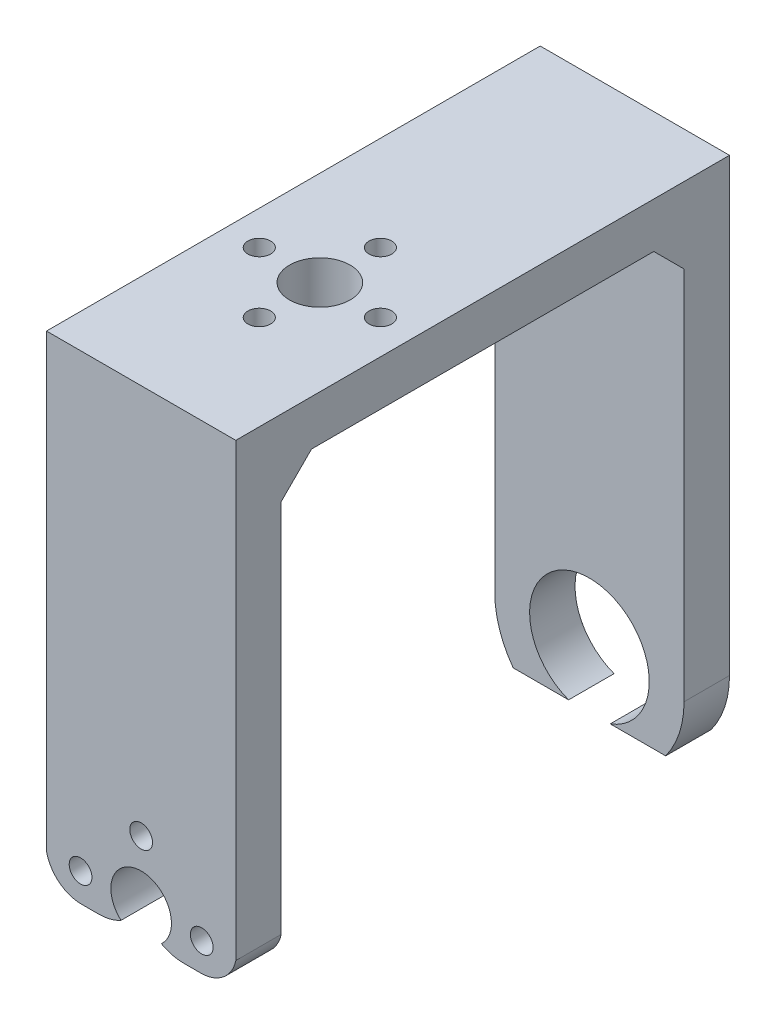
ISO-10303-21;
HEADER;
FILE_DESCRIPTION(('STEP AP214'),'2;1');
FILE_NAME('part.step','',(''),(''),'','','');
FILE_SCHEMA(('AUTOMOTIVE_DESIGN { 1 0 10303 214 1 1 1 1 }'));
ENDSEC;
DATA;
#1=APPLICATION_CONTEXT('core data for automotive mechanical design processes');
#2=APPLICATION_PROTOCOL_DEFINITION('international standard','automotive_design',2000,#1);
#3=PRODUCT_CONTEXT('',#1,'mechanical');
#4=PRODUCT('Part','Part','',(#3));
#5=PRODUCT_RELATED_PRODUCT_CATEGORY('part','',(#4));
#6=PRODUCT_DEFINITION_FORMATION('','',#4);
#7=PRODUCT_DEFINITION_CONTEXT('part definition',#1,'design');
#8=PRODUCT_DEFINITION('design','',#6,#7);
#9=PRODUCT_DEFINITION_SHAPE('','',#8);
#10=(LENGTH_UNIT() NAMED_UNIT(*) SI_UNIT(.MILLI.,.METRE.));
#11=(NAMED_UNIT(*) PLANE_ANGLE_UNIT() SI_UNIT($,.RADIAN.));
#12=(NAMED_UNIT(*) SI_UNIT($,.STERADIAN.) SOLID_ANGLE_UNIT());
#13=UNCERTAINTY_MEASURE_WITH_UNIT(LENGTH_MEASURE(1.E-05),#10,'distance_accuracy_value','');
#14=(GEOMETRIC_REPRESENTATION_CONTEXT(3) GLOBAL_UNCERTAINTY_ASSIGNED_CONTEXT((#13)) GLOBAL_UNIT_ASSIGNED_CONTEXT((#10,
#11,#12)) REPRESENTATION_CONTEXT('',''));
#15=CARTESIAN_POINT('',(0.,0.,0.));
#16=DIRECTION('',(0.,0.,1.));
#17=DIRECTION('',(1.,0.,0.));
#18=AXIS2_PLACEMENT_3D('',#15,#16,#17);
#19=CARTESIAN_POINT('',(25.,0.,0.));
#20=DIRECTION('',(-1.,0.,0.));
#21=DIRECTION('',(0.,0.,1.));
#22=AXIS2_PLACEMENT_3D('',#19,#20,#21);
#23=PLANE('',#22);
#24=DIRECTION('',(0.,-1.,0.));
#25=VECTOR('',#24,1.);
#26=CARTESIAN_POINT('',(25.,-20.3336150365916,32.6));
#27=LINE('',#26,#25);
#28=CARTESIAN_POINT('',(25.,49.6663849634084,32.6));
#29=VERTEX_POINT('',#28);
#30=CARTESIAN_POINT('',(25.,-9.83361503659156,32.6));
#31=VERTEX_POINT('',#30);
#32=EDGE_CURVE('E296',#29,#31,#27,.T.);
#33=ORIENTED_EDGE('',*,*,#32,.T.);
#34=DIRECTION('',(0.,0.,1.));
#35=VECTOR('',#34,1.);
#36=CARTESIAN_POINT('',(25.,-9.83361503659156,-32.601));
#37=LINE('',#36,#35);
#38=CARTESIAN_POINT('',(25.,-9.83361503659156,26.6));
#39=VERTEX_POINT('',#38);
#40=EDGE_CURVE('E394',#39,#31,#37,.T.);
#41=ORIENTED_EDGE('',*,*,#40,.F.);
#42=DIRECTION('',(0.,1.,0.));
#43=VECTOR('',#42,1.);
#44=CARTESIAN_POINT('',(25.,-20.3336150365916,26.6));
#45=LINE('',#44,#43);
#46=CARTESIAN_POINT('',(25.,39.6663849634085,26.6));
#47=VERTEX_POINT('',#46);
#48=EDGE_CURVE('E285',#39,#47,#45,.T.);
#49=ORIENTED_EDGE('',*,*,#48,.T.);
#50=DIRECTION('',(0.,-0.707106781186543,0.707106781186552));
#51=VECTOR('',#50,1.);
#52=CARTESIAN_POINT('',(25.,33.1331924817045,33.1331924817041));
#53=LINE('',#52,#51);
#54=CARTESIAN_POINT('',(25.,43.6663849634084,22.6));
#55=VERTEX_POINT('',#54);
#56=EDGE_CURVE('E331',#47,#55,#53,.F.);
#57=ORIENTED_EDGE('',*,*,#56,.T.);
#58=DIRECTION('',(0.,0.,-1.));
#59=VECTOR('',#58,1.);
#60=CARTESIAN_POINT('',(25.,43.6663849634084,26.6));
#61=LINE('',#60,#59);
#62=CARTESIAN_POINT('',(25.,43.6663849634085,-22.6));
#63=VERTEX_POINT('',#62);
#64=EDGE_CURVE('E287',#55,#63,#61,.T.);
#65=ORIENTED_EDGE('',*,*,#64,.T.);
#66=DIRECTION('',(0.,0.707106781186551,0.707106781186544));
#67=VECTOR('',#66,1.);
#68=CARTESIAN_POINT('',(25.,33.133192481704,-33.1331924817043));
#69=LINE('',#68,#67);
#70=CARTESIAN_POINT('',(25.,39.6663849634084,-26.6));
#71=VERTEX_POINT('',#70);
#72=EDGE_CURVE('E11',#63,#71,#69,.F.);
#73=ORIENTED_EDGE('',*,*,#72,.T.);
#74=DIRECTION('',(0.,-1.,0.));
#75=VECTOR('',#74,1.);
#76=CARTESIAN_POINT('',(25.,-20.3336150365916,-26.6));
#77=LINE('',#76,#75);
#78=CARTESIAN_POINT('',(25.,-9.83361503659156,-26.6));
#79=VERTEX_POINT('',#78);
#80=EDGE_CURVE('E290',#71,#79,#77,.T.);
#81=ORIENTED_EDGE('',*,*,#80,.T.);
#82=DIRECTION('',(0.,0.,-1.));
#83=VECTOR('',#82,1.);
#84=CARTESIAN_POINT('',(25.,-9.83361503659157,32.601));
#85=LINE('',#84,#83);
#86=CARTESIAN_POINT('',(25.,-9.83361503659156,-32.6));
#87=VERTEX_POINT('',#86);
#88=EDGE_CURVE('E280',#79,#87,#85,.T.);
#89=ORIENTED_EDGE('',*,*,#88,.T.);
#90=DIRECTION('',(0.,1.,0.));
#91=VECTOR('',#90,1.);
#92=CARTESIAN_POINT('',(25.,-20.3336150365916,-32.6));
#93=LINE('',#92,#91);
#94=CARTESIAN_POINT('',(25.,49.6663849634085,-32.6));
#95=VERTEX_POINT('',#94);
#96=EDGE_CURVE('E292',#87,#95,#93,.T.);
#97=ORIENTED_EDGE('',*,*,#96,.T.);
#98=DIRECTION('',(0.,0.,1.));
#99=VECTOR('',#98,1.);
#100=CARTESIAN_POINT('',(25.,49.6663849634084,32.6));
#101=LINE('',#100,#99);
#102=EDGE_CURVE('E294',#95,#29,#101,.T.);
#103=ORIENTED_EDGE('',*,*,#102,.T.);
#104=EDGE_LOOP('',(#33,#41,#49,#57,#65,#73,#81,#89,#97,#103));
#105=FACE_BOUND('',#104,.T.);
#106=ADVANCED_FACE('F35',(#105),#23,.F.);
#107=CARTESIAN_POINT('',(0.,0.,0.));
#108=DIRECTION('',(-1.,0.,0.));
#109=DIRECTION('',(0.,0.,1.));
#110=AXIS2_PLACEMENT_3D('',#107,#108,#109);
#111=PLANE('',#110);
#112=DIRECTION('',(0.,0.,1.));
#113=VECTOR('',#112,1.);
#114=CARTESIAN_POINT('',(0.,-9.83361503659156,-32.601));
#115=LINE('',#114,#113);
#116=CARTESIAN_POINT('',(0.,-9.83361503659156,26.6));
#117=VERTEX_POINT('',#116);
#118=CARTESIAN_POINT('',(0.,-9.83361503659156,32.6));
#119=VERTEX_POINT('',#118);
#120=EDGE_CURVE('E212',#117,#119,#115,.T.);
#121=ORIENTED_EDGE('',*,*,#120,.T.);
#122=DIRECTION('',(0.,-1.,0.));
#123=VECTOR('',#122,1.);
#124=CARTESIAN_POINT('',(0.,-20.3336150365916,32.6));
#125=LINE('',#124,#123);
#126=CARTESIAN_POINT('',(0.,49.6663849634084,32.6));
#127=VERTEX_POINT('',#126);
#128=EDGE_CURVE('E288',#127,#119,#125,.T.);
#129=ORIENTED_EDGE('',*,*,#128,.F.);
#130=DIRECTION('',(0.,0.,1.));
#131=VECTOR('',#130,1.);
#132=CARTESIAN_POINT('',(0.,49.6663849634084,32.6));
#133=LINE('',#132,#131);
#134=CARTESIAN_POINT('',(0.,49.6663849634085,-32.6));
#135=VERTEX_POINT('',#134);
#136=EDGE_CURVE('E308',#135,#127,#133,.T.);
#137=ORIENTED_EDGE('',*,*,#136,.F.);
#138=DIRECTION('',(0.,1.,0.));
#139=VECTOR('',#138,1.);
#140=CARTESIAN_POINT('',(0.,-20.3336150365916,-32.6));
#141=LINE('',#140,#139);
#142=CARTESIAN_POINT('',(0.,-9.83361503659156,-32.6));
#143=VERTEX_POINT('',#142);
#144=EDGE_CURVE('E306',#143,#135,#141,.T.);
#145=ORIENTED_EDGE('',*,*,#144,.F.);
#146=DIRECTION('',(0.,0.,-1.));
#147=VECTOR('',#146,1.);
#148=CARTESIAN_POINT('',(0.,-9.83361503659157,32.601));
#149=LINE('',#148,#147);
#150=CARTESIAN_POINT('',(0.,-9.83361503659156,-26.6));
#151=VERTEX_POINT('',#150);
#152=EDGE_CURVE('E278',#151,#143,#149,.T.);
#153=ORIENTED_EDGE('',*,*,#152,.F.);
#154=DIRECTION('',(0.,-1.,0.));
#155=VECTOR('',#154,1.);
#156=CARTESIAN_POINT('',(0.,-20.3336150365916,-26.6));
#157=LINE('',#156,#155);
#158=CARTESIAN_POINT('',(0.,39.6663849634084,-26.6));
#159=VERTEX_POINT('',#158);
#160=EDGE_CURVE('E304',#159,#151,#157,.T.);
#161=ORIENTED_EDGE('',*,*,#160,.F.);
#162=DIRECTION('',(0.,-0.707106781186551,-0.707106781186544));
#163=VECTOR('',#162,1.);
#164=CARTESIAN_POINT('',(0.,39.6663849634084,-26.6));
#165=LINE('',#164,#163);
#166=CARTESIAN_POINT('',(0.,43.6663849634085,-22.6));
#167=VERTEX_POINT('',#166);
#168=EDGE_CURVE('E43',#159,#167,#165,.F.);
#169=ORIENTED_EDGE('',*,*,#168,.T.);
#170=DIRECTION('',(0.,0.,-1.));
#171=VECTOR('',#170,1.);
#172=CARTESIAN_POINT('',(0.,43.6663849634084,26.6));
#173=LINE('',#172,#171);
#174=CARTESIAN_POINT('',(0.,43.6663849634084,22.6));
#175=VERTEX_POINT('',#174);
#176=EDGE_CURVE('E301',#175,#167,#173,.T.);
#177=ORIENTED_EDGE('',*,*,#176,.F.);
#178=DIRECTION('',(0.,0.707106781186543,-0.707106781186552));
#179=VECTOR('',#178,1.);
#180=CARTESIAN_POINT('',(0.,43.6663849634084,22.6));
#181=LINE('',#180,#179);
#182=CARTESIAN_POINT('',(0.,39.6663849634085,26.6));
#183=VERTEX_POINT('',#182);
#184=EDGE_CURVE('E328',#175,#183,#181,.F.);
#185=ORIENTED_EDGE('',*,*,#184,.T.);
#186=DIRECTION('',(0.,1.,0.));
#187=VECTOR('',#186,1.);
#188=CARTESIAN_POINT('',(0.,-20.3336150365916,26.6));
#189=LINE('',#188,#187);
#190=EDGE_CURVE('E271',#117,#183,#189,.T.);
#191=ORIENTED_EDGE('',*,*,#190,.F.);
#192=EDGE_LOOP('',(#121,#129,#137,#145,#153,#161,#169,#177,#185,#191));
#193=FACE_BOUND('',#192,.T.);
#194=ADVANCED_FACE('F336',(#193),#111,.T.);
#195=CARTESIAN_POINT('',(25.,-20.3336150365916,26.6));
#196=DIRECTION('',(0.,0.,1.));
#197=DIRECTION('',(1.,0.,0.));
#198=AXIS2_PLACEMENT_3D('',#195,#196,#197);
#199=PLANE('',#198);
#200=CARTESIAN_POINT('',(4.5,-9.83361503659157,26.6));
#201=DIRECTION('',(0.,0.,1.));
#202=DIRECTION('',(1.,0.,0.));
#203=AXIS2_PLACEMENT_3D('',#200,#201,#202);
#204=CIRCLE('',#203,1.5);
#205=CARTESIAN_POINT('',(6.,-9.83361503659157,26.6));
#206=VERTEX_POINT('',#205);
#207=EDGE_CURVE('E416',#206,#206,#204,.F.);
#208=ORIENTED_EDGE('',*,*,#207,.F.);
#209=EDGE_LOOP('',(#208));
#210=FACE_BOUND('',#209,.T.);
#211=CARTESIAN_POINT('',(12.5,-1.83361503659157,26.6));
#212=DIRECTION('',(0.,0.,1.));
#213=DIRECTION('',(1.,0.,0.));
#214=AXIS2_PLACEMENT_3D('',#211,#212,#213);
#215=CIRCLE('',#214,1.5);
#216=CARTESIAN_POINT('',(14.,-1.83361503659157,26.6));
#217=VERTEX_POINT('',#216);
#218=EDGE_CURVE('E423',#217,#217,#215,.F.);
#219=ORIENTED_EDGE('',*,*,#218,.F.);
#220=EDGE_LOOP('',(#219));
#221=FACE_BOUND('',#220,.T.);
#222=CARTESIAN_POINT('',(20.5,-9.83361503659157,26.6));
#223=DIRECTION('',(0.,0.,1.));
#224=DIRECTION('',(1.,0.,0.));
#225=AXIS2_PLACEMENT_3D('',#222,#223,#224);
#226=CIRCLE('',#225,1.5);
#227=CARTESIAN_POINT('',(22.,-9.83361503659157,26.6));
#228=VERTEX_POINT('',#227);
#229=EDGE_CURVE('E431',#228,#228,#226,.F.);
#230=ORIENTED_EDGE('',*,*,#229,.F.);
#231=EDGE_LOOP('',(#230));
#232=FACE_BOUND('',#231,.T.);
#233=ORIENTED_EDGE('',*,*,#48,.F.);
#234=CARTESIAN_POINT('',(20.3949022686378,-8.8749149936171,26.6));
#235=DIRECTION('',(0.,0.,1.));
#236=DIRECTION('',(1.,0.,0.));
#237=AXIS2_PLACEMENT_3D('',#234,#235,#236);
#238=CIRCLE('',#237,4.70383151141672);
#239=CARTESIAN_POINT('',(20.3949022686378,-13.5787465050338,26.6));
#240=VERTEX_POINT('',#239);
#241=EDGE_CURVE('E193',#240,#39,#238,.T.);
#242=ORIENTED_EDGE('',*,*,#241,.F.);
#243=DIRECTION('',(1.,0.,0.));
#244=VECTOR('',#243,1.);
#245=CARTESIAN_POINT('',(20.3949022686378,-13.5787465050338,26.6));
#246=LINE('',#245,#244);
#247=CARTESIAN_POINT('',(18.1039391702705,-13.5787465050338,26.6));
#248=VERTEX_POINT('',#247);
#249=EDGE_CURVE('E175',#248,#240,#246,.T.);
#250=ORIENTED_EDGE('',*,*,#249,.F.);
#251=CARTESIAN_POINT('',(18.1066775417596,-7.50942214918966,26.6));
#252=DIRECTION('',(0.,0.,1.));
#253=DIRECTION('',(1.,0.,0.));
#254=AXIS2_PLACEMENT_3D('',#251,#252,#253);
#255=CIRCLE('',#254,6.06932497359645);
#256=CARTESIAN_POINT('',(15.1638377890353,-12.8175668179894,26.6));
#257=VERTEX_POINT('',#256);
#258=EDGE_CURVE('E183',#257,#248,#255,.T.);
#259=ORIENTED_EDGE('',*,*,#258,.F.);
#260=CARTESIAN_POINT('',(12.5,-9.83361503659156,26.6));
#261=DIRECTION('',(0.,0.,1.));
#262=DIRECTION('',(1.,0.,0.));
#263=AXIS2_PLACEMENT_3D('',#260,#261,#262);
#264=CIRCLE('',#263,4.);
#265=CARTESIAN_POINT('',(9.83616221096467,-12.8175668179894,26.6));
#266=VERTEX_POINT('',#265);
#267=EDGE_CURVE('E189',#266,#257,#264,.F.);
#268=ORIENTED_EDGE('',*,*,#267,.F.);
#269=CARTESIAN_POINT('',(6.89332245824035,-7.50942214918966,26.6));
#270=DIRECTION('',(0.,0.,1.));
#271=DIRECTION('',(1.,0.,0.));
#272=AXIS2_PLACEMENT_3D('',#269,#270,#271);
#273=CIRCLE('',#272,6.06932497359645);
#274=CARTESIAN_POINT('',(6.89606082972947,-13.5787465050338,26.6));
#275=VERTEX_POINT('',#274);
#276=EDGE_CURVE('E206',#275,#266,#273,.T.);
#277=ORIENTED_EDGE('',*,*,#276,.F.);
#278=DIRECTION('',(1.,0.,0.));
#279=VECTOR('',#278,1.);
#280=CARTESIAN_POINT('',(4.60509773136225,-13.5787465050338,26.6));
#281=LINE('',#280,#279);
#282=CARTESIAN_POINT('',(4.60509773136225,-13.5787465050338,26.6));
#283=VERTEX_POINT('',#282);
#284=EDGE_CURVE('E203',#283,#275,#281,.T.);
#285=ORIENTED_EDGE('',*,*,#284,.F.);
#286=CARTESIAN_POINT('',(4.60509773136225,-8.8749149936171,26.6));
#287=DIRECTION('',(0.,0.,1.));
#288=DIRECTION('',(1.,0.,0.));
#289=AXIS2_PLACEMENT_3D('',#286,#287,#288);
#290=CIRCLE('',#289,4.70383151141672);
#291=EDGE_CURVE('E195',#117,#283,#290,.T.);
#292=ORIENTED_EDGE('',*,*,#291,.F.);
#293=ORIENTED_EDGE('',*,*,#190,.T.);
#294=DIRECTION('',(1.,0.,0.));
#295=VECTOR('',#294,1.);
#296=CARTESIAN_POINT('',(25.,39.6663849634085,26.6));
#297=LINE('',#296,#295);
#298=EDGE_CURVE('E322',#183,#47,#297,.T.);
#299=ORIENTED_EDGE('',*,*,#298,.T.);
#300=EDGE_LOOP('',(#233,#242,#250,#259,#268,#277,#285,#292,#293,#299));
#301=FACE_BOUND('',#300,.T.);
#302=ADVANCED_FACE('F192',(#210,#221,#232,#301),#199,.F.);
#303=CARTESIAN_POINT('',(25.,43.6663849634084,26.6));
#304=DIRECTION('',(0.,1.,0.));
#305=DIRECTION('',(0.,0.,1.));
#306=AXIS2_PLACEMENT_3D('',#303,#304,#305);
#307=PLANE('',#306);
#308=CARTESIAN_POINT('',(20.5,43.6663849634084,8.99999999999999));
#309=DIRECTION('',(0.,1.,0.));
#310=DIRECTION('',(0.,0.,1.));
#311=AXIS2_PLACEMENT_3D('',#308,#309,#310);
#312=CIRCLE('',#311,1.5);
#313=CARTESIAN_POINT('',(20.5,43.6663849634084,10.5));
#314=VERTEX_POINT('',#313);
#315=EDGE_CURVE('E217',#314,#314,#312,.F.);
#316=ORIENTED_EDGE('',*,*,#315,.F.);
#317=EDGE_LOOP('',(#316));
#318=FACE_BOUND('',#317,.T.);
#319=CARTESIAN_POINT('',(12.5,43.6663849634084,17.));
#320=DIRECTION('',(0.,1.,0.));
#321=DIRECTION('',(0.,0.,1.));
#322=AXIS2_PLACEMENT_3D('',#319,#320,#321);
#323=CIRCLE('',#322,1.5);
#324=CARTESIAN_POINT('',(12.5,43.6663849634084,18.5));
#325=VERTEX_POINT('',#324);
#326=EDGE_CURVE('E216',#325,#325,#323,.F.);
#327=ORIENTED_EDGE('',*,*,#326,.F.);
#328=EDGE_LOOP('',(#327));
#329=FACE_BOUND('',#328,.T.);
#330=CARTESIAN_POINT('',(4.5,43.6663849634084,8.99999999999999));
#331=DIRECTION('',(0.,1.,0.));
#332=DIRECTION('',(0.,0.,1.));
#333=AXIS2_PLACEMENT_3D('',#330,#331,#332);
#334=CIRCLE('',#333,1.5);
#335=CARTESIAN_POINT('',(4.5,43.6663849634084,10.5));
#336=VERTEX_POINT('',#335);
#337=EDGE_CURVE('E229',#336,#336,#334,.F.);
#338=ORIENTED_EDGE('',*,*,#337,.F.);
#339=EDGE_LOOP('',(#338));
#340=FACE_BOUND('',#339,.T.);
#341=CARTESIAN_POINT('',(12.5,43.6663849634084,0.999999999999995));
#342=DIRECTION('',(0.,1.,0.));
#343=DIRECTION('',(0.,0.,1.));
#344=AXIS2_PLACEMENT_3D('',#341,#342,#343);
#345=CIRCLE('',#344,1.5);
#346=CARTESIAN_POINT('',(12.5,43.6663849634084,2.49999999999999));
#347=VERTEX_POINT('',#346);
#348=EDGE_CURVE('E228',#347,#347,#345,.F.);
#349=ORIENTED_EDGE('',*,*,#348,.F.);
#350=EDGE_LOOP('',(#349));
#351=FACE_BOUND('',#350,.T.);
#352=CARTESIAN_POINT('',(12.5,43.6663849634084,8.99999999999999));
#353=DIRECTION('',(0.,1.,0.));
#354=DIRECTION('',(0.,0.,1.));
#355=AXIS2_PLACEMENT_3D('',#352,#353,#354);
#356=CIRCLE('',#355,4.);
#357=CARTESIAN_POINT('',(12.5,43.6663849634084,13.));
#358=VERTEX_POINT('',#357);
#359=EDGE_CURVE('E239',#358,#358,#356,.F.);
#360=ORIENTED_EDGE('',*,*,#359,.F.);
#361=EDGE_LOOP('',(#360));
#362=FACE_BOUND('',#361,.T.);
#363=ORIENTED_EDGE('',*,*,#64,.F.);
#364=DIRECTION('',(-1.,0.,0.));
#365=VECTOR('',#364,1.);
#366=CARTESIAN_POINT('',(0.,43.6663849634084,22.6));
#367=LINE('',#366,#365);
#368=EDGE_CURVE('E319',#55,#175,#367,.T.);
#369=ORIENTED_EDGE('',*,*,#368,.T.);
#370=ORIENTED_EDGE('',*,*,#176,.T.);
#371=DIRECTION('',(1.,0.,0.));
#372=VECTOR('',#371,1.);
#373=CARTESIAN_POINT('',(25.,43.6663849634085,-22.6));
#374=LINE('',#373,#372);
#375=EDGE_CURVE('E317',#167,#63,#374,.T.);
#376=ORIENTED_EDGE('',*,*,#375,.T.);
#377=EDGE_LOOP('',(#363,#369,#370,#376));
#378=FACE_BOUND('',#377,.T.);
#379=ADVANCED_FACE('F343',(#318,#329,#340,#351,#362,#378),#307,.F.);
#380=CARTESIAN_POINT('',(25.,-20.3336150365916,-26.6));
#381=DIRECTION('',(0.,0.,-1.));
#382=DIRECTION('',(0.,1.,0.));
#383=AXIS2_PLACEMENT_3D('',#380,#381,#382);
#384=PLANE('',#383);
#385=ORIENTED_EDGE('',*,*,#80,.F.);
#386=DIRECTION('',(-1.,0.,0.));
#387=VECTOR('',#386,1.);
#388=CARTESIAN_POINT('',(0.,39.6663849634084,-26.6));
#389=LINE('',#388,#387);
#390=EDGE_CURVE('E325',#71,#159,#389,.T.);
#391=ORIENTED_EDGE('',*,*,#390,.T.);
#392=ORIENTED_EDGE('',*,*,#160,.T.);
#393=CARTESIAN_POINT('',(12.5,-9.83361503659156,-26.6));
#394=DIRECTION('',(0.,0.,-1.));
#395=DIRECTION('',(0.,1.,0.));
#396=AXIS2_PLACEMENT_3D('',#393,#394,#395);
#397=CIRCLE('',#396,12.5);
#398=CARTESIAN_POINT('',(2.43111613030354,-17.2408802281833,-26.6));
#399=VERTEX_POINT('',#398);
#400=EDGE_CURVE('E264',#399,#151,#397,.T.);
#401=ORIENTED_EDGE('',*,*,#400,.F.);
#402=DIRECTION('',(-1.,0.,0.));
#403=VECTOR('',#402,1.);
#404=CARTESIAN_POINT('',(9.75365290222929,-17.2408802281833,-26.6));
#405=LINE('',#404,#403);
#406=CARTESIAN_POINT('',(9.75365290222929,-17.2408802281833,-26.6));
#407=VERTEX_POINT('',#406);
#408=EDGE_CURVE('E251',#407,#399,#405,.T.);
#409=ORIENTED_EDGE('',*,*,#408,.F.);
#410=CARTESIAN_POINT('',(12.5,-9.83361503659156,-26.6));
#411=DIRECTION('',(0.,0.,-1.));
#412=DIRECTION('',(0.,1.,0.));
#413=AXIS2_PLACEMENT_3D('',#410,#411,#412);
#414=CIRCLE('',#413,7.9);
#415=CARTESIAN_POINT('',(15.2463470977707,-17.2408802281833,-26.6));
#416=VERTEX_POINT('',#415);
#417=EDGE_CURVE('E246',#416,#407,#414,.F.);
#418=ORIENTED_EDGE('',*,*,#417,.F.);
#419=DIRECTION('',(-1.,0.,0.));
#420=VECTOR('',#419,1.);
#421=CARTESIAN_POINT('',(15.2463470977707,-17.2408802281833,-26.6));
#422=LINE('',#421,#420);
#423=CARTESIAN_POINT('',(22.5688838696965,-17.2408802281833,-26.6));
#424=VERTEX_POINT('',#423);
#425=EDGE_CURVE('E243',#424,#416,#422,.T.);
#426=ORIENTED_EDGE('',*,*,#425,.F.);
#427=CARTESIAN_POINT('',(12.5,-9.83361503659156,-26.6));
#428=DIRECTION('',(0.,0.,-1.));
#429=DIRECTION('',(0.,1.,0.));
#430=AXIS2_PLACEMENT_3D('',#427,#428,#429);
#431=CIRCLE('',#430,12.5);
#432=EDGE_CURVE('E247',#79,#424,#431,.T.);
#433=ORIENTED_EDGE('',*,*,#432,.F.);
#434=EDGE_LOOP('',(#385,#391,#392,#401,#409,#418,#426,#433));
#435=FACE_BOUND('',#434,.T.);
#436=ADVANCED_FACE('F346',(#435),#384,.F.);
#437=CARTESIAN_POINT('',(25.,-20.3336150365916,-32.6));
#438=DIRECTION('',(0.,0.,1.));
#439=DIRECTION('',(0.,-1.,0.));
#440=AXIS2_PLACEMENT_3D('',#437,#438,#439);
#441=PLANE('',#440);
#442=DIRECTION('',(1.,0.,0.));
#443=VECTOR('',#442,1.);
#444=CARTESIAN_POINT('',(9.75365290222929,-17.2408802281833,-32.6));
#445=LINE('',#444,#443);
#446=CARTESIAN_POINT('',(2.43111613030354,-17.2408802281833,-32.6));
#447=VERTEX_POINT('',#446);
#448=CARTESIAN_POINT('',(9.75365290222929,-17.2408802281833,-32.6));
#449=VERTEX_POINT('',#448);
#450=EDGE_CURVE('E248',#447,#449,#445,.T.);
#451=ORIENTED_EDGE('',*,*,#450,.F.);
#452=CARTESIAN_POINT('',(12.5,-9.83361503659156,-32.6));
#453=DIRECTION('',(0.,0.,1.));
#454=DIRECTION('',(0.,1.,0.));
#455=AXIS2_PLACEMENT_3D('',#452,#453,#454);
#456=CIRCLE('',#455,12.5);
#457=EDGE_CURVE('E252',#143,#447,#456,.T.);
#458=ORIENTED_EDGE('',*,*,#457,.F.);
#459=ORIENTED_EDGE('',*,*,#144,.T.);
#460=DIRECTION('',(-1.,0.,0.));
#461=VECTOR('',#460,1.);
#462=CARTESIAN_POINT('',(25.,49.6663849634085,-32.6));
#463=LINE('',#462,#461);
#464=EDGE_CURVE('E314',#95,#135,#463,.T.);
#465=ORIENTED_EDGE('',*,*,#464,.F.);
#466=ORIENTED_EDGE('',*,*,#96,.F.);
#467=CARTESIAN_POINT('',(12.5,-9.83361503659156,-32.6));
#468=DIRECTION('',(0.,0.,1.));
#469=DIRECTION('',(0.,-1.,0.));
#470=AXIS2_PLACEMENT_3D('',#467,#468,#469);
#471=CIRCLE('',#470,12.5);
#472=CARTESIAN_POINT('',(22.5688838696965,-17.2408802281833,-32.6));
#473=VERTEX_POINT('',#472);
#474=EDGE_CURVE('E255',#473,#87,#471,.T.);
#475=ORIENTED_EDGE('',*,*,#474,.F.);
#476=DIRECTION('',(1.,0.,0.));
#477=VECTOR('',#476,1.);
#478=CARTESIAN_POINT('',(15.2463470977707,-17.2408802281833,-32.6));
#479=LINE('',#478,#477);
#480=CARTESIAN_POINT('',(15.2463470977707,-17.2408802281833,-32.6));
#481=VERTEX_POINT('',#480);
#482=EDGE_CURVE('E257',#481,#473,#479,.T.);
#483=ORIENTED_EDGE('',*,*,#482,.F.);
#484=CARTESIAN_POINT('',(12.5,-9.83361503659156,-32.6));
#485=DIRECTION('',(0.,0.,-1.));
#486=DIRECTION('',(0.,-1.,0.));
#487=AXIS2_PLACEMENT_3D('',#484,#485,#486);
#488=CIRCLE('',#487,7.9);
#489=EDGE_CURVE('E260',#449,#481,#488,.T.);
#490=ORIENTED_EDGE('',*,*,#489,.F.);
#491=EDGE_LOOP('',(#451,#458,#459,#465,#466,#475,#483,#490));
#492=FACE_BOUND('',#491,.T.);
#493=ADVANCED_FACE('F358',(#492),#441,.F.);
#494=CARTESIAN_POINT('',(25.,49.6663849634084,32.6));
#495=DIRECTION('',(0.,-1.,0.));
#496=DIRECTION('',(0.,0.,-1.));
#497=AXIS2_PLACEMENT_3D('',#494,#495,#496);
#498=PLANE('',#497);
#499=CARTESIAN_POINT('',(20.5,49.6663849634084,8.99999999999999));
#500=DIRECTION('',(0.,1.,0.));
#501=DIRECTION('',(0.,0.,-1.));
#502=AXIS2_PLACEMENT_3D('',#499,#500,#501);
#503=CIRCLE('',#502,1.5);
#504=CARTESIAN_POINT('',(20.5,49.6663849634084,7.49999999999999));
#505=VERTEX_POINT('',#504);
#506=EDGE_CURVE('E188',#505,#505,#503,.T.);
#507=ORIENTED_EDGE('',*,*,#506,.F.);
#508=EDGE_LOOP('',(#507));
#509=FACE_BOUND('',#508,.T.);
#510=CARTESIAN_POINT('',(12.5,49.6663849634084,17.));
#511=DIRECTION('',(0.,1.,0.));
#512=DIRECTION('',(0.,0.,-1.));
#513=AXIS2_PLACEMENT_3D('',#510,#511,#512);
#514=CIRCLE('',#513,1.5);
#515=CARTESIAN_POINT('',(12.5,49.6663849634084,15.5));
#516=VERTEX_POINT('',#515);
#517=EDGE_CURVE('E213',#516,#516,#514,.T.);
#518=ORIENTED_EDGE('',*,*,#517,.F.);
#519=EDGE_LOOP('',(#518));
#520=FACE_BOUND('',#519,.T.);
#521=CARTESIAN_POINT('',(4.5,49.6663849634084,8.99999999999999));
#522=DIRECTION('',(0.,1.,0.));
#523=DIRECTION('',(0.,0.,1.));
#524=AXIS2_PLACEMENT_3D('',#521,#522,#523);
#525=CIRCLE('',#524,1.5);
#526=CARTESIAN_POINT('',(4.5,49.6663849634084,10.5));
#527=VERTEX_POINT('',#526);
#528=EDGE_CURVE('E220',#527,#527,#525,.T.);
#529=ORIENTED_EDGE('',*,*,#528,.F.);
#530=EDGE_LOOP('',(#529));
#531=FACE_BOUND('',#530,.T.);
#532=CARTESIAN_POINT('',(12.5,49.6663849634084,0.999999999999996));
#533=DIRECTION('',(0.,1.,0.));
#534=DIRECTION('',(0.,0.,1.));
#535=AXIS2_PLACEMENT_3D('',#532,#533,#534);
#536=CIRCLE('',#535,1.5);
#537=CARTESIAN_POINT('',(12.5,49.6663849634084,2.49999999999999));
#538=VERTEX_POINT('',#537);
#539=EDGE_CURVE('E225',#538,#538,#536,.T.);
#540=ORIENTED_EDGE('',*,*,#539,.F.);
#541=EDGE_LOOP('',(#540));
#542=FACE_BOUND('',#541,.T.);
#543=CARTESIAN_POINT('',(12.5,49.6663849634084,8.99999999999999));
#544=DIRECTION('',(0.,1.,0.));
#545=DIRECTION('',(0.,0.,1.));
#546=AXIS2_PLACEMENT_3D('',#543,#544,#545);
#547=CIRCLE('',#546,4.);
#548=CARTESIAN_POINT('',(12.5,49.6663849634084,13.));
#549=VERTEX_POINT('',#548);
#550=EDGE_CURVE('E232',#549,#549,#547,.T.);
#551=ORIENTED_EDGE('',*,*,#550,.F.);
#552=EDGE_LOOP('',(#551));
#553=FACE_BOUND('',#552,.T.);
#554=ORIENTED_EDGE('',*,*,#136,.T.);
#555=DIRECTION('',(-1.,0.,0.));
#556=VECTOR('',#555,1.);
#557=CARTESIAN_POINT('',(25.,49.6663849634084,32.6));
#558=LINE('',#557,#556);
#559=EDGE_CURVE('E299',#29,#127,#558,.T.);
#560=ORIENTED_EDGE('',*,*,#559,.F.);
#561=ORIENTED_EDGE('',*,*,#102,.F.);
#562=ORIENTED_EDGE('',*,*,#464,.T.);
#563=EDGE_LOOP('',(#554,#560,#561,#562));
#564=FACE_BOUND('',#563,.T.);
#565=ADVANCED_FACE('F366',(#509,#520,#531,#542,#553,#564),#498,.F.);
#566=CARTESIAN_POINT('',(25.,-20.3336150365916,32.6));
#567=DIRECTION('',(0.,0.,-1.));
#568=DIRECTION('',(-1.,0.,0.));
#569=AXIS2_PLACEMENT_3D('',#566,#567,#568);
#570=PLANE('',#569);
#571=CARTESIAN_POINT('',(4.5,-9.83361503659157,32.6));
#572=DIRECTION('',(0.,0.,1.));
#573=DIRECTION('',(1.,0.,0.));
#574=AXIS2_PLACEMENT_3D('',#571,#572,#573);
#575=CIRCLE('',#574,1.5);
#576=CARTESIAN_POINT('',(6.,-9.83361503659157,32.6));
#577=VERTEX_POINT('',#576);
#578=EDGE_CURVE('E418',#577,#577,#575,.T.);
#579=ORIENTED_EDGE('',*,*,#578,.F.);
#580=EDGE_LOOP('',(#579));
#581=FACE_BOUND('',#580,.T.);
#582=CARTESIAN_POINT('',(12.5,-1.83361503659157,32.6));
#583=DIRECTION('',(0.,0.,1.));
#584=DIRECTION('',(1.,0.,0.));
#585=AXIS2_PLACEMENT_3D('',#582,#583,#584);
#586=CIRCLE('',#585,1.5);
#587=CARTESIAN_POINT('',(14.,-1.83361503659157,32.6));
#588=VERTEX_POINT('',#587);
#589=EDGE_CURVE('E428',#588,#588,#586,.T.);
#590=ORIENTED_EDGE('',*,*,#589,.F.);
#591=EDGE_LOOP('',(#590));
#592=FACE_BOUND('',#591,.T.);
#593=CARTESIAN_POINT('',(20.5,-9.83361503659157,32.6));
#594=DIRECTION('',(0.,0.,1.));
#595=DIRECTION('',(1.,0.,0.));
#596=AXIS2_PLACEMENT_3D('',#593,#594,#595);
#597=CIRCLE('',#596,1.5);
#598=CARTESIAN_POINT('',(22.,-9.83361503659157,32.6));
#599=VERTEX_POINT('',#598);
#600=EDGE_CURVE('E434',#599,#599,#597,.T.);
#601=ORIENTED_EDGE('',*,*,#600,.F.);
#602=EDGE_LOOP('',(#601));
#603=FACE_BOUND('',#602,.T.);
#604=DIRECTION('',(-1.,0.,0.));
#605=VECTOR('',#604,1.);
#606=CARTESIAN_POINT('',(20.3949022686378,-13.5787465050338,32.6));
#607=LINE('',#606,#605);
#608=CARTESIAN_POINT('',(20.3949022686378,-13.5787465050338,32.6));
#609=VERTEX_POINT('',#608);
#610=CARTESIAN_POINT('',(18.1039391702705,-13.5787465050338,32.6));
#611=VERTEX_POINT('',#610);
#612=EDGE_CURVE('E178',#609,#611,#607,.T.);
#613=ORIENTED_EDGE('',*,*,#612,.F.);
#614=CARTESIAN_POINT('',(20.3949022686378,-8.8749149936171,32.6));
#615=DIRECTION('',(0.,0.,-1.));
#616=DIRECTION('',(-1.,0.,0.));
#617=AXIS2_PLACEMENT_3D('',#614,#615,#616);
#618=CIRCLE('',#617,4.70383151141672);
#619=EDGE_CURVE('E197',#31,#609,#618,.T.);
#620=ORIENTED_EDGE('',*,*,#619,.F.);
#621=ORIENTED_EDGE('',*,*,#32,.F.);
#622=ORIENTED_EDGE('',*,*,#559,.T.);
#623=ORIENTED_EDGE('',*,*,#128,.T.);
#624=CARTESIAN_POINT('',(4.60509773136225,-8.8749149936171,32.6));
#625=DIRECTION('',(0.,0.,-1.));
#626=DIRECTION('',(1.,0.,0.));
#627=AXIS2_PLACEMENT_3D('',#624,#625,#626);
#628=CIRCLE('',#627,4.70383151141672);
#629=CARTESIAN_POINT('',(4.60509773136225,-13.5787465050338,32.6));
#630=VERTEX_POINT('',#629);
#631=EDGE_CURVE('E374',#630,#119,#628,.T.);
#632=ORIENTED_EDGE('',*,*,#631,.F.);
#633=DIRECTION('',(-1.,0.,0.));
#634=VECTOR('',#633,1.);
#635=CARTESIAN_POINT('',(4.60509773136225,-13.5787465050338,32.6));
#636=LINE('',#635,#634);
#637=CARTESIAN_POINT('',(6.89606082972947,-13.5787465050338,32.6));
#638=VERTEX_POINT('',#637);
#639=EDGE_CURVE('E376',#638,#630,#636,.T.);
#640=ORIENTED_EDGE('',*,*,#639,.F.);
#641=CARTESIAN_POINT('',(6.89332245824035,-7.50942214918966,32.6));
#642=DIRECTION('',(0.,0.,-1.));
#643=DIRECTION('',(1.,0.,0.));
#644=AXIS2_PLACEMENT_3D('',#641,#642,#643);
#645=CIRCLE('',#644,6.06932497359645);
#646=CARTESIAN_POINT('',(9.83616221096467,-12.8175668179894,32.6));
#647=VERTEX_POINT('',#646);
#648=EDGE_CURVE('E381',#647,#638,#645,.T.);
#649=ORIENTED_EDGE('',*,*,#648,.F.);
#650=CARTESIAN_POINT('',(12.5,-9.83361503659156,32.6));
#651=DIRECTION('',(0.,0.,1.));
#652=DIRECTION('',(-1.,0.,0.));
#653=AXIS2_PLACEMENT_3D('',#650,#651,#652);
#654=CIRCLE('',#653,4.);
#655=CARTESIAN_POINT('',(15.1638377890353,-12.8175668179894,32.6));
#656=VERTEX_POINT('',#655);
#657=EDGE_CURVE('E384',#656,#647,#654,.T.);
#658=ORIENTED_EDGE('',*,*,#657,.F.);
#659=CARTESIAN_POINT('',(18.1066775417596,-7.50942214918966,32.6));
#660=DIRECTION('',(0.,0.,-1.));
#661=DIRECTION('',(-1.,0.,0.));
#662=AXIS2_PLACEMENT_3D('',#659,#660,#661);
#663=CIRCLE('',#662,6.06932497359645);
#664=EDGE_CURVE('E50',#611,#656,#663,.T.);
#665=ORIENTED_EDGE('',*,*,#664,.F.);
#666=EDGE_LOOP('',(#613,#620,#621,#622,#623,#632,#640,#649,#658,#665));
#667=FACE_BOUND('',#666,.T.);
#668=ADVANCED_FACE('F371',(#581,#592,#603,#667),#570,.F.);
#669=CARTESIAN_POINT('',(12.5,-9.83361503659157,32.601));
#670=DIRECTION('',(0.,0.,-1.));
#671=DIRECTION('',(0.,1.,0.));
#672=AXIS2_PLACEMENT_3D('',#669,#670,#671);
#673=CYLINDRICAL_SURFACE('',#672,7.9);
#674=ORIENTED_EDGE('',*,*,#417,.T.);
#675=DIRECTION('',(0.,0.,-1.));
#676=VECTOR('',#675,1.);
#677=CARTESIAN_POINT('',(9.75365290222929,-17.2408802281833,32.601));
#678=LINE('',#677,#676);
#679=EDGE_CURVE('E274',#407,#449,#678,.T.);
#680=ORIENTED_EDGE('',*,*,#679,.T.);
#681=ORIENTED_EDGE('',*,*,#489,.T.);
#682=DIRECTION('',(0.,0.,-1.));
#683=VECTOR('',#682,1.);
#684=CARTESIAN_POINT('',(15.2463470977707,-17.2408802281833,32.601));
#685=LINE('',#684,#683);
#686=EDGE_CURVE('E242',#416,#481,#685,.T.);
#687=ORIENTED_EDGE('',*,*,#686,.F.);
#688=EDGE_LOOP('',(#674,#680,#681,#687));
#689=FACE_BOUND('',#688,.T.);
#690=ADVANCED_FACE('F442',(#689),#673,.F.);
#691=CARTESIAN_POINT('',(9.75365290222929,-17.2408802281833,32.601));
#692=DIRECTION('',(0.,1.,0.));
#693=DIRECTION('',(0.,0.,1.));
#694=AXIS2_PLACEMENT_3D('',#691,#692,#693);
#695=PLANE('',#694);
#696=ORIENTED_EDGE('',*,*,#408,.T.);
#697=DIRECTION('',(0.,0.,-1.));
#698=VECTOR('',#697,1.);
#699=CARTESIAN_POINT('',(2.43111613030354,-17.2408802281833,32.601));
#700=LINE('',#699,#698);
#701=EDGE_CURVE('E276',#399,#447,#700,.T.);
#702=ORIENTED_EDGE('',*,*,#701,.T.);
#703=ORIENTED_EDGE('',*,*,#450,.T.);
#704=ORIENTED_EDGE('',*,*,#679,.F.);
#705=EDGE_LOOP('',(#696,#702,#703,#704));
#706=FACE_BOUND('',#705,.T.);
#707=ADVANCED_FACE('F449',(#706),#695,.F.);
#708=CARTESIAN_POINT('',(12.5,-9.83361503659157,32.601));
#709=DIRECTION('',(0.,0.,-1.));
#710=DIRECTION('',(0.,1.,0.));
#711=AXIS2_PLACEMENT_3D('',#708,#709,#710);
#712=CYLINDRICAL_SURFACE('',#711,12.5);
#713=ORIENTED_EDGE('',*,*,#400,.T.);
#714=ORIENTED_EDGE('',*,*,#152,.T.);
#715=ORIENTED_EDGE('',*,*,#457,.T.);
#716=ORIENTED_EDGE('',*,*,#701,.F.);
#717=EDGE_LOOP('',(#713,#714,#715,#716));
#718=FACE_BOUND('',#717,.T.);
#719=ADVANCED_FACE('F465',(#718),#712,.T.);
#720=CARTESIAN_POINT('',(12.5,-9.83361503659157,32.601));
#721=DIRECTION('',(0.,0.,-1.));
#722=DIRECTION('',(0.,1.,0.));
#723=AXIS2_PLACEMENT_3D('',#720,#721,#722);
#724=CYLINDRICAL_SURFACE('',#723,12.5);
#725=ORIENTED_EDGE('',*,*,#432,.T.);
#726=DIRECTION('',(0.,0.,-1.));
#727=VECTOR('',#726,1.);
#728=CARTESIAN_POINT('',(22.5688838696965,-17.2408802281833,32.601));
#729=LINE('',#728,#727);
#730=EDGE_CURVE('E263',#424,#473,#729,.T.);
#731=ORIENTED_EDGE('',*,*,#730,.T.);
#732=ORIENTED_EDGE('',*,*,#474,.T.);
#733=ORIENTED_EDGE('',*,*,#88,.F.);
#734=EDGE_LOOP('',(#725,#731,#732,#733));
#735=FACE_BOUND('',#734,.T.);
#736=ADVANCED_FACE('F353',(#735),#724,.T.);
#737=CARTESIAN_POINT('',(15.2463470977707,-17.2408802281833,32.601));
#738=DIRECTION('',(0.,1.,0.));
#739=DIRECTION('',(0.,0.,1.));
#740=AXIS2_PLACEMENT_3D('',#737,#738,#739);
#741=PLANE('',#740);
#742=ORIENTED_EDGE('',*,*,#425,.T.);
#743=ORIENTED_EDGE('',*,*,#686,.T.);
#744=ORIENTED_EDGE('',*,*,#482,.T.);
#745=ORIENTED_EDGE('',*,*,#730,.F.);
#746=EDGE_LOOP('',(#742,#743,#744,#745));
#747=FACE_BOUND('',#746,.T.);
#748=ADVANCED_FACE('F472',(#747),#741,.F.);
#749=CARTESIAN_POINT('',(12.5,-20.3346150365916,8.99999999999999));
#750=DIRECTION('',(0.,1.,0.));
#751=DIRECTION('',(0.,0.,1.));
#752=AXIS2_PLACEMENT_3D('',#749,#750,#751);
#753=CYLINDRICAL_SURFACE('',#752,4.);
#754=ORIENTED_EDGE('',*,*,#550,.T.);
#755=EDGE_LOOP('',(#754));
#756=FACE_BOUND('',#755,.T.);
#757=ORIENTED_EDGE('',*,*,#359,.T.);
#758=EDGE_LOOP('',(#757));
#759=FACE_BOUND('',#758,.T.);
#760=ADVANCED_FACE('F475',(#756,#759),#753,.F.);
#761=CARTESIAN_POINT('',(12.5,-20.3346150365916,0.999999999999987));
#762=DIRECTION('',(0.,1.,0.));
#763=DIRECTION('',(0.,0.,1.));
#764=AXIS2_PLACEMENT_3D('',#761,#762,#763);
#765=CYLINDRICAL_SURFACE('',#764,1.5);
#766=ORIENTED_EDGE('',*,*,#539,.T.);
#767=EDGE_LOOP('',(#766));
#768=FACE_BOUND('',#767,.T.);
#769=ORIENTED_EDGE('',*,*,#348,.T.);
#770=EDGE_LOOP('',(#769));
#771=FACE_BOUND('',#770,.T.);
#772=ADVANCED_FACE('F479',(#768,#771),#765,.F.);
#773=CARTESIAN_POINT('',(4.5,-20.3346150365916,8.99999999999998));
#774=DIRECTION('',(0.,1.,0.));
#775=DIRECTION('',(0.,0.,1.));
#776=AXIS2_PLACEMENT_3D('',#773,#774,#775);
#777=CYLINDRICAL_SURFACE('',#776,1.5);
#778=ORIENTED_EDGE('',*,*,#528,.T.);
#779=EDGE_LOOP('',(#778));
#780=FACE_BOUND('',#779,.T.);
#781=ORIENTED_EDGE('',*,*,#337,.T.);
#782=EDGE_LOOP('',(#781));
#783=FACE_BOUND('',#782,.T.);
#784=ADVANCED_FACE('F481',(#780,#783),#777,.F.);
#785=CARTESIAN_POINT('',(12.5,-20.3346150365916,17.));
#786=DIRECTION('',(0.,1.,0.));
#787=DIRECTION('',(0.,0.,1.));
#788=AXIS2_PLACEMENT_3D('',#785,#786,#787);
#789=CYLINDRICAL_SURFACE('',#788,1.5);
#790=ORIENTED_EDGE('',*,*,#517,.T.);
#791=EDGE_LOOP('',(#790));
#792=FACE_BOUND('',#791,.T.);
#793=ORIENTED_EDGE('',*,*,#326,.T.);
#794=EDGE_LOOP('',(#793));
#795=FACE_BOUND('',#794,.T.);
#796=ADVANCED_FACE('F484',(#792,#795),#789,.F.);
#797=CARTESIAN_POINT('',(20.5,-20.3346150365916,8.99999999999998));
#798=DIRECTION('',(0.,1.,0.));
#799=DIRECTION('',(0.,0.,1.));
#800=AXIS2_PLACEMENT_3D('',#797,#798,#799);
#801=CYLINDRICAL_SURFACE('',#800,1.5);
#802=ORIENTED_EDGE('',*,*,#506,.T.);
#803=EDGE_LOOP('',(#802));
#804=FACE_BOUND('',#803,.T.);
#805=ORIENTED_EDGE('',*,*,#315,.T.);
#806=EDGE_LOOP('',(#805));
#807=FACE_BOUND('',#806,.T.);
#808=ADVANCED_FACE('F489',(#804,#807),#801,.F.);
#809=CARTESIAN_POINT('',(25.,43.6663849634084,22.6));
#810=DIRECTION('',(0.,-0.707106781186552,-0.707106781186543));
#811=DIRECTION('',(1.,0.,0.));
#812=AXIS2_PLACEMENT_3D('',#809,#810,#811);
#813=PLANE('',#812);
#814=ORIENTED_EDGE('',*,*,#56,.F.);
#815=ORIENTED_EDGE('',*,*,#298,.F.);
#816=ORIENTED_EDGE('',*,*,#184,.F.);
#817=ORIENTED_EDGE('',*,*,#368,.F.);
#818=EDGE_LOOP('',(#814,#815,#816,#817));
#819=FACE_BOUND('',#818,.T.);
#820=ADVANCED_FACE('F402',(#819),#813,.T.);
#821=CARTESIAN_POINT('',(25.,39.6663849634084,-26.6));
#822=DIRECTION('',(0.,-0.707106781186544,0.707106781186551));
#823=DIRECTION('',(1.,0.,0.));
#824=AXIS2_PLACEMENT_3D('',#821,#822,#823);
#825=PLANE('',#824);
#826=ORIENTED_EDGE('',*,*,#72,.F.);
#827=ORIENTED_EDGE('',*,*,#375,.F.);
#828=ORIENTED_EDGE('',*,*,#168,.F.);
#829=ORIENTED_EDGE('',*,*,#390,.F.);
#830=EDGE_LOOP('',(#826,#827,#828,#829));
#831=FACE_BOUND('',#830,.T.);
#832=ADVANCED_FACE('F37',(#831),#825,.T.);
#833=CARTESIAN_POINT('',(18.1066775417596,-7.50942214918966,-32.601));
#834=DIRECTION('',(0.,0.,1.));
#835=DIRECTION('',(1.,0.,0.));
#836=AXIS2_PLACEMENT_3D('',#833,#834,#835);
#837=CYLINDRICAL_SURFACE('',#836,6.06932497359645);
#838=ORIENTED_EDGE('',*,*,#258,.T.);
#839=DIRECTION('',(0.,0.,1.));
#840=VECTOR('',#839,1.);
#841=CARTESIAN_POINT('',(18.1039391702705,-13.5787465050338,-32.601));
#842=LINE('',#841,#840);
#843=EDGE_CURVE('E171',#248,#611,#842,.T.);
#844=ORIENTED_EDGE('',*,*,#843,.T.);
#845=ORIENTED_EDGE('',*,*,#664,.T.);
#846=DIRECTION('',(0.,0.,1.));
#847=VECTOR('',#846,1.);
#848=CARTESIAN_POINT('',(15.1638377890353,-12.8175668179894,-32.601));
#849=LINE('',#848,#847);
#850=EDGE_CURVE('E180',#257,#656,#849,.T.);
#851=ORIENTED_EDGE('',*,*,#850,.F.);
#852=EDGE_LOOP('',(#838,#844,#845,#851));
#853=FACE_BOUND('',#852,.T.);
#854=ADVANCED_FACE('F184',(#853),#837,.T.);
#855=CARTESIAN_POINT('',(20.3949022686378,-13.5787465050338,-32.601));
#856=DIRECTION('',(0.,1.,0.));
#857=DIRECTION('',(0.,0.,1.));
#858=AXIS2_PLACEMENT_3D('',#855,#856,#857);
#859=PLANE('',#858);
#860=ORIENTED_EDGE('',*,*,#249,.T.);
#861=DIRECTION('',(0.,0.,1.));
#862=VECTOR('',#861,1.);
#863=CARTESIAN_POINT('',(20.3949022686378,-13.5787465050338,-32.601));
#864=LINE('',#863,#862);
#865=EDGE_CURVE('E179',#240,#609,#864,.T.);
#866=ORIENTED_EDGE('',*,*,#865,.T.);
#867=ORIENTED_EDGE('',*,*,#612,.T.);
#868=ORIENTED_EDGE('',*,*,#843,.F.);
#869=EDGE_LOOP('',(#860,#866,#867,#868));
#870=FACE_BOUND('',#869,.T.);
#871=ADVANCED_FACE('F173',(#870),#859,.F.);
#872=CARTESIAN_POINT('',(20.3949022686378,-8.8749149936171,-32.601));
#873=DIRECTION('',(0.,0.,1.));
#874=DIRECTION('',(1.,0.,0.));
#875=AXIS2_PLACEMENT_3D('',#872,#873,#874);
#876=CYLINDRICAL_SURFACE('',#875,4.70383151141672);
#877=ORIENTED_EDGE('',*,*,#241,.T.);
#878=ORIENTED_EDGE('',*,*,#40,.T.);
#879=ORIENTED_EDGE('',*,*,#619,.T.);
#880=ORIENTED_EDGE('',*,*,#865,.F.);
#881=EDGE_LOOP('',(#877,#878,#879,#880));
#882=FACE_BOUND('',#881,.T.);
#883=ADVANCED_FACE('F396',(#882),#876,.T.);
#884=CARTESIAN_POINT('',(4.60509773136225,-8.8749149936171,-32.601));
#885=DIRECTION('',(0.,0.,1.));
#886=DIRECTION('',(1.,0.,0.));
#887=AXIS2_PLACEMENT_3D('',#884,#885,#886);
#888=CYLINDRICAL_SURFACE('',#887,4.70383151141672);
#889=ORIENTED_EDGE('',*,*,#291,.T.);
#890=DIRECTION('',(0.,0.,1.));
#891=VECTOR('',#890,1.);
#892=CARTESIAN_POINT('',(4.60509773136225,-13.5787465050338,-32.601));
#893=LINE('',#892,#891);
#894=EDGE_CURVE('E209',#283,#630,#893,.T.);
#895=ORIENTED_EDGE('',*,*,#894,.T.);
#896=ORIENTED_EDGE('',*,*,#631,.T.);
#897=ORIENTED_EDGE('',*,*,#120,.F.);
#898=EDGE_LOOP('',(#889,#895,#896,#897));
#899=FACE_BOUND('',#898,.T.);
#900=ADVANCED_FACE('F407',(#899),#888,.T.);
#901=CARTESIAN_POINT('',(4.60509773136225,-13.5787465050338,-32.601));
#902=DIRECTION('',(0.,1.,0.));
#903=DIRECTION('',(0.,0.,1.));
#904=AXIS2_PLACEMENT_3D('',#901,#902,#903);
#905=PLANE('',#904);
#906=ORIENTED_EDGE('',*,*,#284,.T.);
#907=DIRECTION('',(0.,0.,1.));
#908=VECTOR('',#907,1.);
#909=CARTESIAN_POINT('',(6.89606082972947,-13.5787465050338,-32.601));
#910=LINE('',#909,#908);
#911=EDGE_CURVE('E211',#275,#638,#910,.T.);
#912=ORIENTED_EDGE('',*,*,#911,.T.);
#913=ORIENTED_EDGE('',*,*,#639,.T.);
#914=ORIENTED_EDGE('',*,*,#894,.F.);
#915=EDGE_LOOP('',(#906,#912,#913,#914));
#916=FACE_BOUND('',#915,.T.);
#917=ADVANCED_FACE('F410',(#916),#905,.F.);
#918=CARTESIAN_POINT('',(6.89332245824035,-7.50942214918966,-32.601));
#919=DIRECTION('',(0.,0.,1.));
#920=DIRECTION('',(1.,0.,0.));
#921=AXIS2_PLACEMENT_3D('',#918,#919,#920);
#922=CYLINDRICAL_SURFACE('',#921,6.06932497359645);
#923=ORIENTED_EDGE('',*,*,#276,.T.);
#924=DIRECTION('',(0.,0.,1.));
#925=VECTOR('',#924,1.);
#926=CARTESIAN_POINT('',(9.83616221096467,-12.8175668179894,-32.601));
#927=LINE('',#926,#925);
#928=EDGE_CURVE('E386',#266,#647,#927,.T.);
#929=ORIENTED_EDGE('',*,*,#928,.T.);
#930=ORIENTED_EDGE('',*,*,#648,.T.);
#931=ORIENTED_EDGE('',*,*,#911,.F.);
#932=EDGE_LOOP('',(#923,#929,#930,#931));
#933=FACE_BOUND('',#932,.T.);
#934=ADVANCED_FACE('F412',(#933),#922,.T.);
#935=CARTESIAN_POINT('',(12.5,-9.83361503659156,-32.601));
#936=DIRECTION('',(0.,0.,1.));
#937=DIRECTION('',(1.,0.,0.));
#938=AXIS2_PLACEMENT_3D('',#935,#936,#937);
#939=CYLINDRICAL_SURFACE('',#938,4.);
#940=ORIENTED_EDGE('',*,*,#267,.T.);
#941=ORIENTED_EDGE('',*,*,#850,.T.);
#942=ORIENTED_EDGE('',*,*,#657,.T.);
#943=ORIENTED_EDGE('',*,*,#928,.F.);
#944=EDGE_LOOP('',(#940,#941,#942,#943));
#945=FACE_BOUND('',#944,.T.);
#946=ADVANCED_FACE('F415',(#945),#939,.F.);
#947=CARTESIAN_POINT('',(20.5,-9.83361503659157,-32.601));
#948=DIRECTION('',(0.,0.,1.));
#949=DIRECTION('',(1.,0.,0.));
#950=AXIS2_PLACEMENT_3D('',#947,#948,#949);
#951=CYLINDRICAL_SURFACE('',#950,1.5);
#952=ORIENTED_EDGE('',*,*,#600,.T.);
#953=EDGE_LOOP('',(#952));
#954=FACE_BOUND('',#953,.T.);
#955=ORIENTED_EDGE('',*,*,#229,.T.);
#956=EDGE_LOOP('',(#955));
#957=FACE_BOUND('',#956,.T.);
#958=ADVANCED_FACE('F438',(#954,#957),#951,.F.);
#959=CARTESIAN_POINT('',(12.5,-1.83361503659157,-32.601));
#960=DIRECTION('',(0.,0.,1.));
#961=DIRECTION('',(1.,0.,0.));
#962=AXIS2_PLACEMENT_3D('',#959,#960,#961);
#963=CYLINDRICAL_SURFACE('',#962,1.5);
#964=ORIENTED_EDGE('',*,*,#589,.T.);
#965=EDGE_LOOP('',(#964));
#966=FACE_BOUND('',#965,.T.);
#967=ORIENTED_EDGE('',*,*,#218,.T.);
#968=EDGE_LOOP('',(#967));
#969=FACE_BOUND('',#968,.T.);
#970=ADVANCED_FACE('F512',(#966,#969),#963,.F.);
#971=CARTESIAN_POINT('',(4.5,-9.83361503659157,-32.601));
#972=DIRECTION('',(0.,0.,1.));
#973=DIRECTION('',(1.,0.,0.));
#974=AXIS2_PLACEMENT_3D('',#971,#972,#973);
#975=CYLINDRICAL_SURFACE('',#974,1.5);
#976=ORIENTED_EDGE('',*,*,#578,.T.);
#977=EDGE_LOOP('',(#976));
#978=FACE_BOUND('',#977,.T.);
#979=ORIENTED_EDGE('',*,*,#207,.T.);
#980=EDGE_LOOP('',(#979));
#981=FACE_BOUND('',#980,.T.);
#982=ADVANCED_FACE('F515',(#978,#981),#975,.F.);
#983=CLOSED_SHELL('',(#106,#194,#302,#379,#436,#493,#565,#668,#690,#707,#719,#736,#748,#760,
#772,#784,#796,#808,#820,#832,#854,#871,#883,#900,#917,#934,#946,#958,#970,#982));
#984=MANIFOLD_SOLID_BREP('B2',#983);
#985=ADVANCED_BREP_SHAPE_REPRESENTATION('',(#18,#984),#14);
#986=SHAPE_DEFINITION_REPRESENTATION(#9,#985);
ENDSEC;
END-ISO-10303-21;
